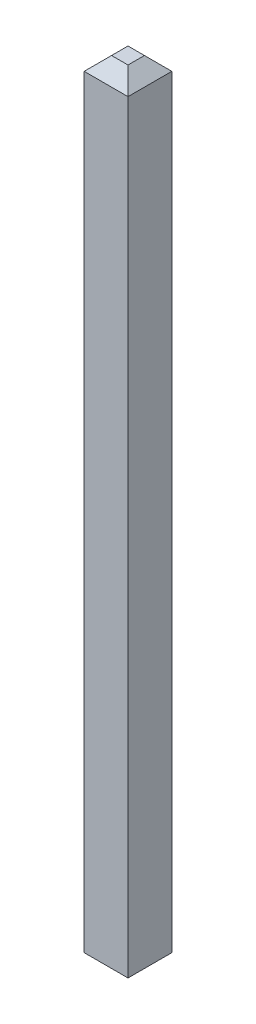
ISO-10303-21;
HEADER;
FILE_DESCRIPTION(('STEP AP214'),'2;1');
FILE_NAME('part.step','',(''),(''),'','','');
FILE_SCHEMA(('AUTOMOTIVE_DESIGN { 1 0 10303 214 1 1 1 1 }'));
ENDSEC;
DATA;
#1=APPLICATION_CONTEXT('core data for automotive mechanical design processes');
#2=APPLICATION_PROTOCOL_DEFINITION('international standard','automotive_design',2000,#1);
#3=PRODUCT_CONTEXT('',#1,'mechanical');
#4=PRODUCT('Part','Part','',(#3));
#5=PRODUCT_RELATED_PRODUCT_CATEGORY('part','',(#4));
#6=PRODUCT_DEFINITION_FORMATION('','',#4);
#7=PRODUCT_DEFINITION_CONTEXT('part definition',#1,'design');
#8=PRODUCT_DEFINITION('design','',#6,#7);
#9=PRODUCT_DEFINITION_SHAPE('','',#8);
#10=(LENGTH_UNIT() NAMED_UNIT(*) SI_UNIT(.MILLI.,.METRE.));
#11=(NAMED_UNIT(*) PLANE_ANGLE_UNIT() SI_UNIT($,.RADIAN.));
#12=(NAMED_UNIT(*) SI_UNIT($,.STERADIAN.) SOLID_ANGLE_UNIT());
#13=UNCERTAINTY_MEASURE_WITH_UNIT(LENGTH_MEASURE(1.E-05),#10,'distance_accuracy_value','');
#14=(GEOMETRIC_REPRESENTATION_CONTEXT(3) GLOBAL_UNCERTAINTY_ASSIGNED_CONTEXT((#13)) GLOBAL_UNIT_ASSIGNED_CONTEXT((#10,
#11,#12)) REPRESENTATION_CONTEXT('',''));
#15=CARTESIAN_POINT('',(0.,0.,0.));
#16=DIRECTION('',(0.,0.,1.));
#17=DIRECTION('',(1.,0.,0.));
#18=AXIS2_PLACEMENT_3D('',#15,#16,#17);
#19=CARTESIAN_POINT('',(4.13,7.07,-0.32));
#20=DIRECTION('',(-0.707106781186548,-0.707106781186548,0.));
#21=DIRECTION('',(-0.707106781186548,0.707106781186548,0.));
#22=AXIS2_PLACEMENT_3D('',#19,#20,#21);
#23=PLANE('',#22);
#24=DIRECTION('',(0.577350269189626,-0.577350269189626,0.577350269189626));
#25=VECTOR('',#24,1.);
#26=CARTESIAN_POINT('',(3.916666666667,7.283333333333,0.106666666667));
#27=LINE('',#26,#25);
#28=CARTESIAN_POINT('',(3.93,7.27,0.12));
#29=VERTEX_POINT('',#28);
#30=CARTESIAN_POINT('',(4.13,7.07,0.32));
#31=VERTEX_POINT('',#30);
#32=EDGE_CURVE('E95',#29,#31,#27,.T.);
#33=ORIENTED_EDGE('',*,*,#32,.T.);
#34=DIRECTION('',(0.,0.,1.));
#35=VECTOR('',#34,1.);
#36=CARTESIAN_POINT('',(4.13,7.07,-0.32));
#37=LINE('',#36,#35);
#38=CARTESIAN_POINT('',(4.13,7.07,-0.32));
#39=VERTEX_POINT('',#38);
#40=EDGE_CURVE('E119',#39,#31,#37,.T.);
#41=ORIENTED_EDGE('',*,*,#40,.F.);
#42=DIRECTION('',(0.577350269189626,-0.577350269189626,-0.577350269189626));
#43=VECTOR('',#42,1.);
#44=CARTESIAN_POINT('',(4.13,7.07,-0.32));
#45=LINE('',#44,#43);
#46=CARTESIAN_POINT('',(3.93,7.27,-0.12));
#47=VERTEX_POINT('',#46);
#48=EDGE_CURVE('E11',#47,#39,#45,.T.);
#49=ORIENTED_EDGE('',*,*,#48,.F.);
#50=DIRECTION('',(0.,0.,-1.));
#51=VECTOR('',#50,1.);
#52=CARTESIAN_POINT('',(3.93,7.27,-0.32));
#53=LINE('',#52,#51);
#54=EDGE_CURVE('E123',#29,#47,#53,.T.);
#55=ORIENTED_EDGE('',*,*,#54,.F.);
#56=EDGE_LOOP('',(#33,#41,#49,#55));
#57=FACE_BOUND('',#56,.T.);
#58=ADVANCED_FACE('F16',(#57),#23,.F.);
#59=CARTESIAN_POINT('',(3.81,7.07,-0.32));
#60=DIRECTION('',(0.,0.707106781186548,-0.707106781186548));
#61=DIRECTION('',(-1.,0.,0.));
#62=AXIS2_PLACEMENT_3D('',#59,#60,#61);
#63=PLANE('',#62);
#64=DIRECTION('',(0.577350269189626,0.577350269189626,0.577350269189626));
#65=VECTOR('',#64,1.);
#66=CARTESIAN_POINT('',(3.623333333333,7.203333333333,-0.186666666667));
#67=LINE('',#66,#65);
#68=CARTESIAN_POINT('',(3.49,7.07,-0.32));
#69=VERTEX_POINT('',#68);
#70=CARTESIAN_POINT('',(3.69,7.27,-0.12));
#71=VERTEX_POINT('',#70);
#72=EDGE_CURVE('E26',#69,#71,#67,.T.);
#73=ORIENTED_EDGE('',*,*,#72,.T.);
#74=DIRECTION('',(-1.,0.,0.));
#75=VECTOR('',#74,1.);
#76=CARTESIAN_POINT('',(3.49,7.27,-0.12));
#77=LINE('',#76,#75);
#78=EDGE_CURVE('E20',#47,#71,#77,.T.);
#79=ORIENTED_EDGE('',*,*,#78,.F.);
#80=ORIENTED_EDGE('',*,*,#48,.T.);
#81=DIRECTION('',(1.,0.,0.));
#82=VECTOR('',#81,1.);
#83=CARTESIAN_POINT('',(4.13,7.07,-0.32));
#84=LINE('',#83,#82);
#85=EDGE_CURVE('E115',#69,#39,#84,.T.);
#86=ORIENTED_EDGE('',*,*,#85,.F.);
#87=EDGE_LOOP('',(#73,#79,#80,#86));
#88=FACE_BOUND('',#87,.T.);
#89=ADVANCED_FACE('F113',(#88),#63,.T.);
#90=CARTESIAN_POINT('',(3.69,7.27,-0.32));
#91=DIRECTION('',(0.707106781186548,-0.707106781186548,0.));
#92=DIRECTION('',(0.,0.,-1.));
#93=AXIS2_PLACEMENT_3D('',#90,#91,#92);
#94=PLANE('',#93);
#95=DIRECTION('',(-0.577350269189626,-0.577350269189626,0.577350269189626));
#96=VECTOR('',#95,1.);
#97=CARTESIAN_POINT('',(3.623333333333,7.203333333333,0.186666666667));
#98=LINE('',#97,#96);
#99=CARTESIAN_POINT('',(3.69,7.27,0.12));
#100=VERTEX_POINT('',#99);
#101=CARTESIAN_POINT('',(3.49,7.07,0.32));
#102=VERTEX_POINT('',#101);
#103=EDGE_CURVE('E39',#100,#102,#98,.T.);
#104=ORIENTED_EDGE('',*,*,#103,.F.);
#105=DIRECTION('',(0.,0.,1.));
#106=VECTOR('',#105,1.);
#107=CARTESIAN_POINT('',(3.69,7.27,-0.32));
#108=LINE('',#107,#106);
#109=EDGE_CURVE('E176',#71,#100,#108,.T.);
#110=ORIENTED_EDGE('',*,*,#109,.F.);
#111=ORIENTED_EDGE('',*,*,#72,.F.);
#112=DIRECTION('',(0.,0.,-1.));
#113=VECTOR('',#112,1.);
#114=CARTESIAN_POINT('',(3.49,7.07,-0.32));
#115=LINE('',#114,#113);
#116=EDGE_CURVE('E151',#102,#69,#115,.T.);
#117=ORIENTED_EDGE('',*,*,#116,.F.);
#118=EDGE_LOOP('',(#104,#110,#111,#117));
#119=FACE_BOUND('',#118,.T.);
#120=ADVANCED_FACE('F242',(#119),#94,.F.);
#121=CARTESIAN_POINT('',(3.49,7.27,0.12));
#122=DIRECTION('',(0.,-0.707106781186548,-0.707106781186548));
#123=DIRECTION('',(0.,-0.707106781186548,0.707106781186548));
#124=AXIS2_PLACEMENT_3D('',#121,#122,#123);
#125=PLANE('',#124);
#126=ORIENTED_EDGE('',*,*,#32,.F.);
#127=DIRECTION('',(1.,0.,0.));
#128=VECTOR('',#127,1.);
#129=CARTESIAN_POINT('',(3.49,7.27,0.12));
#130=LINE('',#129,#128);
#131=EDGE_CURVE('E166',#100,#29,#130,.T.);
#132=ORIENTED_EDGE('',*,*,#131,.F.);
#133=ORIENTED_EDGE('',*,*,#103,.T.);
#134=DIRECTION('',(-1.,0.,0.));
#135=VECTOR('',#134,1.);
#136=CARTESIAN_POINT('',(3.81,7.07,0.32));
#137=LINE('',#136,#135);
#138=EDGE_CURVE('E124',#31,#102,#137,.T.);
#139=ORIENTED_EDGE('',*,*,#138,.F.);
#140=EDGE_LOOP('',(#126,#132,#133,#139));
#141=FACE_BOUND('',#140,.T.);
#142=ADVANCED_FACE('F210',(#141),#125,.F.);
#143=CARTESIAN_POINT('',(3.49,7.27,-0.32));
#144=DIRECTION('',(0.,-1.,0.));
#145=DIRECTION('',(0.,0.,-1.));
#146=AXIS2_PLACEMENT_3D('',#143,#144,#145);
#147=PLANE('',#146);
#148=ORIENTED_EDGE('',*,*,#54,.T.);
#149=ORIENTED_EDGE('',*,*,#78,.T.);
#150=ORIENTED_EDGE('',*,*,#109,.T.);
#151=ORIENTED_EDGE('',*,*,#131,.T.);
#152=EDGE_LOOP('',(#148,#149,#150,#151));
#153=FACE_BOUND('',#152,.T.);
#154=ADVANCED_FACE('F208',(#153),#147,.F.);
#155=CARTESIAN_POINT('',(4.13,7.27,-0.32));
#156=DIRECTION('',(-1.,0.,0.));
#157=DIRECTION('',(0.,1.,0.));
#158=AXIS2_PLACEMENT_3D('',#155,#156,#157);
#159=PLANE('',#158);
#160=DIRECTION('',(0.,-1.,0.));
#161=VECTOR('',#160,1.);
#162=CARTESIAN_POINT('',(4.13,7.27,-0.32));
#163=LINE('',#162,#161);
#164=CARTESIAN_POINT('',(4.13,-4.07,-0.32));
#165=VERTEX_POINT('',#164);
#166=EDGE_CURVE('E127',#39,#165,#163,.T.);
#167=ORIENTED_EDGE('',*,*,#166,.F.);
#168=ORIENTED_EDGE('',*,*,#40,.T.);
#169=DIRECTION('',(0.,-1.,0.));
#170=VECTOR('',#169,1.);
#171=CARTESIAN_POINT('',(4.13,7.27,0.32));
#172=LINE('',#171,#170);
#173=CARTESIAN_POINT('',(4.13,-4.07,0.32));
#174=VERTEX_POINT('',#173);
#175=EDGE_CURVE('E105',#31,#174,#172,.T.);
#176=ORIENTED_EDGE('',*,*,#175,.T.);
#177=DIRECTION('',(0.,0.,-1.));
#178=VECTOR('',#177,1.);
#179=CARTESIAN_POINT('',(4.13,-4.07,-0.32));
#180=LINE('',#179,#178);
#181=EDGE_CURVE('E129',#174,#165,#180,.T.);
#182=ORIENTED_EDGE('',*,*,#181,.T.);
#183=EDGE_LOOP('',(#167,#168,#176,#182));
#184=FACE_BOUND('',#183,.T.);
#185=ADVANCED_FACE('F128',(#184),#159,.F.);
#186=CARTESIAN_POINT('',(3.81,1.5,0.32));
#187=DIRECTION('',(0.,0.,-1.));
#188=DIRECTION('',(0.,-1.,0.));
#189=AXIS2_PLACEMENT_3D('',#186,#187,#188);
#190=PLANE('',#189);
#191=ORIENTED_EDGE('',*,*,#175,.F.);
#192=ORIENTED_EDGE('',*,*,#138,.T.);
#193=DIRECTION('',(0.,1.,0.));
#194=VECTOR('',#193,1.);
#195=CARTESIAN_POINT('',(3.49,-4.27,0.32));
#196=LINE('',#195,#194);
#197=CARTESIAN_POINT('',(3.49,-4.07,0.32));
#198=VERTEX_POINT('',#197);
#199=EDGE_CURVE('E134',#198,#102,#196,.T.);
#200=ORIENTED_EDGE('',*,*,#199,.F.);
#201=DIRECTION('',(1.,0.,0.));
#202=VECTOR('',#201,1.);
#203=CARTESIAN_POINT('',(3.81,-4.07,0.32));
#204=LINE('',#203,#202);
#205=EDGE_CURVE('E155',#198,#174,#204,.T.);
#206=ORIENTED_EDGE('',*,*,#205,.T.);
#207=EDGE_LOOP('',(#191,#192,#200,#206));
#208=FACE_BOUND('',#207,.T.);
#209=ADVANCED_FACE('F213',(#208),#190,.F.);
#210=CARTESIAN_POINT('',(3.93,-4.27,-0.32));
#211=DIRECTION('',(-0.707106781186548,0.707106781186548,0.));
#212=DIRECTION('',(0.,0.,1.));
#213=AXIS2_PLACEMENT_3D('',#210,#211,#212);
#214=PLANE('',#213);
#215=DIRECTION('',(-0.577350269189626,-0.577350269189626,0.577350269189626));
#216=VECTOR('',#215,1.);
#217=CARTESIAN_POINT('',(3.996666666667,-4.203333333333,-0.186666666667));
#218=LINE('',#217,#216);
#219=CARTESIAN_POINT('',(3.93,-4.27,-0.12));
#220=VERTEX_POINT('',#219);
#221=EDGE_CURVE('E145',#165,#220,#218,.T.);
#222=ORIENTED_EDGE('',*,*,#221,.F.);
#223=ORIENTED_EDGE('',*,*,#181,.F.);
#224=DIRECTION('',(-0.577350269189626,-0.577350269189626,-0.577350269189626));
#225=VECTOR('',#224,1.);
#226=CARTESIAN_POINT('',(3.783333333333,-4.416666666667,-0.02666666666667));
#227=LINE('',#226,#225);
#228=CARTESIAN_POINT('',(3.93,-4.27,0.12));
#229=VERTEX_POINT('',#228);
#230=EDGE_CURVE('E159',#174,#229,#227,.T.);
#231=ORIENTED_EDGE('',*,*,#230,.T.);
#232=DIRECTION('',(0.,0.,1.));
#233=VECTOR('',#232,1.);
#234=CARTESIAN_POINT('',(3.93,-4.27,-0.32));
#235=LINE('',#234,#233);
#236=EDGE_CURVE('E172',#220,#229,#235,.T.);
#237=ORIENTED_EDGE('',*,*,#236,.F.);
#238=EDGE_LOOP('',(#222,#223,#231,#237));
#239=FACE_BOUND('',#238,.T.);
#240=ADVANCED_FACE('F221',(#239),#214,.F.);
#241=CARTESIAN_POINT('',(4.13,-4.27,0.12));
#242=DIRECTION('',(0.,0.707106781186548,-0.707106781186548));
#243=DIRECTION('',(-1.,0.,0.));
#244=AXIS2_PLACEMENT_3D('',#241,#242,#243);
#245=PLANE('',#244);
#246=ORIENTED_EDGE('',*,*,#230,.F.);
#247=ORIENTED_EDGE('',*,*,#205,.F.);
#248=DIRECTION('',(-0.577350269189626,0.577350269189626,0.577350269189626));
#249=VECTOR('',#248,1.);
#250=CARTESIAN_POINT('',(3.703333333333,-4.283333333333,0.106666666667));
#251=LINE('',#250,#249);
#252=CARTESIAN_POINT('',(3.69,-4.27,0.12));
#253=VERTEX_POINT('',#252);
#254=EDGE_CURVE('E182',#253,#198,#251,.T.);
#255=ORIENTED_EDGE('',*,*,#254,.F.);
#256=DIRECTION('',(-1.,0.,0.));
#257=VECTOR('',#256,1.);
#258=CARTESIAN_POINT('',(4.13,-4.27,0.12));
#259=LINE('',#258,#257);
#260=EDGE_CURVE('E167',#229,#253,#259,.T.);
#261=ORIENTED_EDGE('',*,*,#260,.F.);
#262=EDGE_LOOP('',(#246,#247,#255,#261));
#263=FACE_BOUND('',#262,.T.);
#264=ADVANCED_FACE('F217',(#263),#245,.F.);
#265=CARTESIAN_POINT('',(3.49,-4.07,-0.32));
#266=DIRECTION('',(0.707106781186548,0.707106781186548,0.));
#267=DIRECTION('',(0.,0.,-1.));
#268=AXIS2_PLACEMENT_3D('',#265,#266,#267);
#269=PLANE('',#268);
#270=DIRECTION('',(0.577350269189626,-0.577350269189626,0.577350269189626));
#271=VECTOR('',#270,1.);
#272=CARTESIAN_POINT('',(3.596666666667,-4.176666666667,-0.213333333333));
#273=LINE('',#272,#271);
#274=CARTESIAN_POINT('',(3.49,-4.07,-0.32));
#275=VERTEX_POINT('',#274);
#276=CARTESIAN_POINT('',(3.69,-4.27,-0.12));
#277=VERTEX_POINT('',#276);
#278=EDGE_CURVE('E196',#275,#277,#273,.T.);
#279=ORIENTED_EDGE('',*,*,#278,.T.);
#280=DIRECTION('',(0.,0.,-1.));
#281=VECTOR('',#280,1.);
#282=CARTESIAN_POINT('',(3.69,-4.27,-0.32));
#283=LINE('',#282,#281);
#284=EDGE_CURVE('E171',#253,#277,#283,.T.);
#285=ORIENTED_EDGE('',*,*,#284,.F.);
#286=ORIENTED_EDGE('',*,*,#254,.T.);
#287=DIRECTION('',(0.,0.,1.));
#288=VECTOR('',#287,1.);
#289=CARTESIAN_POINT('',(3.49,-4.07,-0.32));
#290=LINE('',#289,#288);
#291=EDGE_CURVE('E154',#275,#198,#290,.T.);
#292=ORIENTED_EDGE('',*,*,#291,.F.);
#293=EDGE_LOOP('',(#279,#285,#286,#292));
#294=FACE_BOUND('',#293,.T.);
#295=ADVANCED_FACE('F239',(#294),#269,.F.);
#296=CARTESIAN_POINT('',(3.49,-4.27,-0.32));
#297=DIRECTION('',(1.,0.,0.));
#298=DIRECTION('',(0.,0.,1.));
#299=AXIS2_PLACEMENT_3D('',#296,#297,#298);
#300=PLANE('',#299);
#301=ORIENTED_EDGE('',*,*,#199,.T.);
#302=ORIENTED_EDGE('',*,*,#116,.T.);
#303=DIRECTION('',(0.,1.,0.));
#304=VECTOR('',#303,1.);
#305=CARTESIAN_POINT('',(3.49,-4.27,-0.32));
#306=LINE('',#305,#304);
#307=EDGE_CURVE('E138',#275,#69,#306,.T.);
#308=ORIENTED_EDGE('',*,*,#307,.F.);
#309=ORIENTED_EDGE('',*,*,#291,.T.);
#310=EDGE_LOOP('',(#301,#302,#308,#309));
#311=FACE_BOUND('',#310,.T.);
#312=ADVANCED_FACE('F241',(#311),#300,.F.);
#313=CARTESIAN_POINT('',(3.81,1.5,-0.32));
#314=DIRECTION('',(0.,0.,-1.));
#315=DIRECTION('',(0.,-1.,0.));
#316=AXIS2_PLACEMENT_3D('',#313,#314,#315);
#317=PLANE('',#316);
#318=ORIENTED_EDGE('',*,*,#307,.T.);
#319=ORIENTED_EDGE('',*,*,#85,.T.);
#320=ORIENTED_EDGE('',*,*,#166,.T.);
#321=DIRECTION('',(-1.,0.,0.));
#322=VECTOR('',#321,1.);
#323=CARTESIAN_POINT('',(3.49,-4.07,-0.32));
#324=LINE('',#323,#322);
#325=EDGE_CURVE('E187',#165,#275,#324,.T.);
#326=ORIENTED_EDGE('',*,*,#325,.T.);
#327=EDGE_LOOP('',(#318,#319,#320,#326));
#328=FACE_BOUND('',#327,.T.);
#329=ADVANCED_FACE('F136',(#328),#317,.T.);
#330=CARTESIAN_POINT('',(3.81,-4.07,-0.32));
#331=DIRECTION('',(0.,-0.707106781186548,-0.707106781186548));
#332=DIRECTION('',(0.,-0.707106781186548,0.707106781186548));
#333=AXIS2_PLACEMENT_3D('',#330,#331,#332);
#334=PLANE('',#333);
#335=ORIENTED_EDGE('',*,*,#278,.F.);
#336=ORIENTED_EDGE('',*,*,#325,.F.);
#337=ORIENTED_EDGE('',*,*,#221,.T.);
#338=DIRECTION('',(1.,0.,0.));
#339=VECTOR('',#338,1.);
#340=CARTESIAN_POINT('',(4.13,-4.27,-0.12));
#341=LINE('',#340,#339);
#342=EDGE_CURVE('E149',#277,#220,#341,.T.);
#343=ORIENTED_EDGE('',*,*,#342,.F.);
#344=EDGE_LOOP('',(#335,#336,#337,#343));
#345=FACE_BOUND('',#344,.T.);
#346=ADVANCED_FACE('F18',(#345),#334,.T.);
#347=CARTESIAN_POINT('',(4.13,-4.27,-0.32));
#348=DIRECTION('',(0.,1.,0.));
#349=DIRECTION('',(0.,0.,-1.));
#350=AXIS2_PLACEMENT_3D('',#347,#348,#349);
#351=PLANE('',#350);
#352=ORIENTED_EDGE('',*,*,#236,.T.);
#353=ORIENTED_EDGE('',*,*,#260,.T.);
#354=ORIENTED_EDGE('',*,*,#284,.T.);
#355=ORIENTED_EDGE('',*,*,#342,.T.);
#356=EDGE_LOOP('',(#352,#353,#354,#355));
#357=FACE_BOUND('',#356,.T.);
#358=ADVANCED_FACE('F238',(#357),#351,.F.);
#359=CLOSED_SHELL('',(#58,#89,#120,#142,#154,#185,#209,#240,#264,#295,#312,#329,#346,#358));
#360=MANIFOLD_SOLID_BREP('B1',#359);
#361=ADVANCED_BREP_SHAPE_REPRESENTATION('',(#18,#360),#14);
#362=SHAPE_DEFINITION_REPRESENTATION(#9,#361);
ENDSEC;
END-ISO-10303-21;
